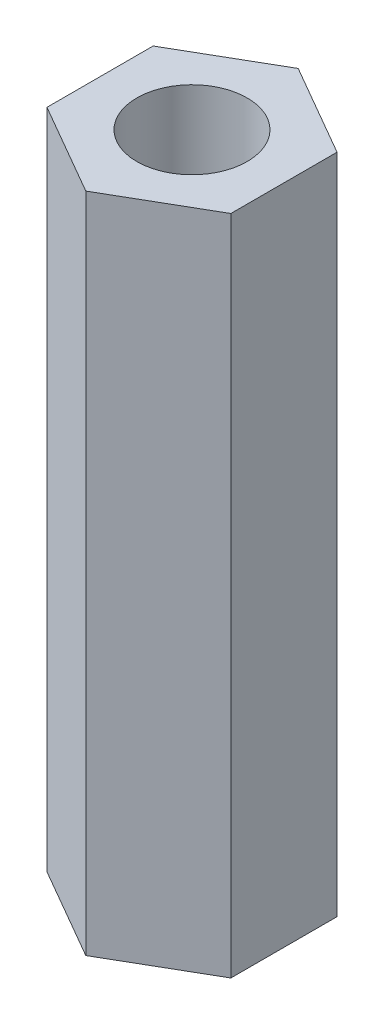
ISO-10303-21;
HEADER;
FILE_DESCRIPTION(('STEP AP214'),'2;1');
FILE_NAME('part.step','',(''),(''),'','','');
FILE_SCHEMA(('AUTOMOTIVE_DESIGN { 1 0 10303 214 1 1 1 1 }'));
ENDSEC;
DATA;
#1=APPLICATION_CONTEXT('core data for automotive mechanical design processes');
#2=APPLICATION_PROTOCOL_DEFINITION('international standard','automotive_design',2000,#1);
#3=PRODUCT_CONTEXT('',#1,'mechanical');
#4=PRODUCT('Part','Part','',(#3));
#5=PRODUCT_RELATED_PRODUCT_CATEGORY('part','',(#4));
#6=PRODUCT_DEFINITION_FORMATION('','',#4);
#7=PRODUCT_DEFINITION_CONTEXT('part definition',#1,'design');
#8=PRODUCT_DEFINITION('design','',#6,#7);
#9=PRODUCT_DEFINITION_SHAPE('','',#8);
#10=(LENGTH_UNIT() NAMED_UNIT(*) SI_UNIT(.MILLI.,.METRE.));
#11=(NAMED_UNIT(*) PLANE_ANGLE_UNIT() SI_UNIT($,.RADIAN.));
#12=(NAMED_UNIT(*) SI_UNIT($,.STERADIAN.) SOLID_ANGLE_UNIT());
#13=UNCERTAINTY_MEASURE_WITH_UNIT(LENGTH_MEASURE(1.E-05),#10,'distance_accuracy_value','');
#14=(GEOMETRIC_REPRESENTATION_CONTEXT(3) GLOBAL_UNCERTAINTY_ASSIGNED_CONTEXT((#13)) GLOBAL_UNIT_ASSIGNED_CONTEXT((#10,
#11,#12)) REPRESENTATION_CONTEXT('',''));
#15=CARTESIAN_POINT('',(0.,0.,0.));
#16=DIRECTION('',(0.,0.,1.));
#17=DIRECTION('',(1.,0.,0.));
#18=AXIS2_PLACEMENT_3D('',#15,#16,#17);
#19=CARTESIAN_POINT('',(0.,18.,0.));
#20=DIRECTION('',(0.,1.,0.));
#21=DIRECTION('',(0.,0.,1.));
#22=AXIS2_PLACEMENT_3D('',#19,#20,#21);
#23=PLANE('',#22);
#24=DIRECTION('',(-0.866025403784439,0.,-0.5));
#25=VECTOR('',#24,1.);
#26=CARTESIAN_POINT('',(2.5,18.,-1.44337567297407));
#27=LINE('',#26,#25);
#28=CARTESIAN_POINT('',(2.5,18.,-1.44337567297407));
#29=VERTEX_POINT('',#28);
#30=CARTESIAN_POINT('',(0.,18.,-2.88675134594813));
#31=VERTEX_POINT('',#30);
#32=EDGE_CURVE('E129',#29,#31,#27,.T.);
#33=ORIENTED_EDGE('',*,*,#32,.T.);
#34=DIRECTION('',(-0.866025403784439,0.,0.5));
#35=VECTOR('',#34,1.);
#36=CARTESIAN_POINT('',(0.,18.,-2.88675134594813));
#37=LINE('',#36,#35);
#38=CARTESIAN_POINT('',(-2.5,18.,-1.44337567297407));
#39=VERTEX_POINT('',#38);
#40=EDGE_CURVE('E87',#31,#39,#37,.T.);
#41=ORIENTED_EDGE('',*,*,#40,.T.);
#42=DIRECTION('',(0.,0.,1.));
#43=VECTOR('',#42,1.);
#44=CARTESIAN_POINT('',(-2.5,18.,-1.44337567297407));
#45=LINE('',#44,#43);
#46=CARTESIAN_POINT('',(-2.5,18.,1.44337567297406));
#47=VERTEX_POINT('',#46);
#48=EDGE_CURVE('E100',#39,#47,#45,.T.);
#49=ORIENTED_EDGE('',*,*,#48,.T.);
#50=DIRECTION('',(0.866025403784439,0.,0.5));
#51=VECTOR('',#50,1.);
#52=CARTESIAN_POINT('',(-2.5,18.,1.44337567297406));
#53=LINE('',#52,#51);
#54=CARTESIAN_POINT('',(0.,18.,2.88675134594813));
#55=VERTEX_POINT('',#54);
#56=EDGE_CURVE('E94',#47,#55,#53,.T.);
#57=ORIENTED_EDGE('',*,*,#56,.T.);
#58=DIRECTION('',(0.866025403784439,0.,-0.5));
#59=VECTOR('',#58,1.);
#60=CARTESIAN_POINT('',(0.,18.,2.88675134594813));
#61=LINE('',#60,#59);
#62=CARTESIAN_POINT('',(2.5,18.,1.44337567297407));
#63=VERTEX_POINT('',#62);
#64=EDGE_CURVE('E98',#55,#63,#61,.T.);
#65=ORIENTED_EDGE('',*,*,#64,.T.);
#66=DIRECTION('',(0.,0.,-1.));
#67=VECTOR('',#66,1.);
#68=CARTESIAN_POINT('',(2.5,18.,1.44337567297407));
#69=LINE('',#68,#67);
#70=EDGE_CURVE('E50',#63,#29,#69,.T.);
#71=ORIENTED_EDGE('',*,*,#70,.T.);
#72=EDGE_LOOP('',(#33,#41,#49,#57,#65,#71));
#73=FACE_BOUND('',#72,.T.);
#74=CARTESIAN_POINT('',(0.,18.,0.));
#75=DIRECTION('',(0.,1.,0.));
#76=DIRECTION('',(0.,0.,1.));
#77=AXIS2_PLACEMENT_3D('',#74,#75,#76);
#78=CIRCLE('',#77,1.5);
#79=CARTESIAN_POINT('',(0.,18.,1.5));
#80=VERTEX_POINT('',#79);
#81=EDGE_CURVE('E122',#80,#80,#78,.T.);
#82=ORIENTED_EDGE('',*,*,#81,.F.);
#83=EDGE_LOOP('',(#82));
#84=FACE_BOUND('',#83,.T.);
#85=ADVANCED_FACE('F33',(#73,#84),#23,.T.);
#86=CARTESIAN_POINT('',(0.,0.,0.));
#87=DIRECTION('',(0.,1.,0.));
#88=DIRECTION('',(0.,0.,1.));
#89=AXIS2_PLACEMENT_3D('',#86,#87,#88);
#90=PLANE('',#89);
#91=DIRECTION('',(-0.866025403784439,0.,-0.5));
#92=VECTOR('',#91,1.);
#93=CARTESIAN_POINT('',(2.5,0.,-1.44337567297407));
#94=LINE('',#93,#92);
#95=CARTESIAN_POINT('',(2.5,0.,-1.44337567297407));
#96=VERTEX_POINT('',#95);
#97=CARTESIAN_POINT('',(0.,0.,-2.88675134594813));
#98=VERTEX_POINT('',#97);
#99=EDGE_CURVE('E118',#96,#98,#94,.T.);
#100=ORIENTED_EDGE('',*,*,#99,.F.);
#101=DIRECTION('',(0.,0.,-1.));
#102=VECTOR('',#101,1.);
#103=CARTESIAN_POINT('',(2.5,0.,1.44337567297407));
#104=LINE('',#103,#102);
#105=CARTESIAN_POINT('',(2.5,0.,1.44337567297407));
#106=VERTEX_POINT('',#105);
#107=EDGE_CURVE('E79',#106,#96,#104,.T.);
#108=ORIENTED_EDGE('',*,*,#107,.F.);
#109=DIRECTION('',(0.866025403784439,0.,-0.5));
#110=VECTOR('',#109,1.);
#111=CARTESIAN_POINT('',(0.,0.,2.88675134594813));
#112=LINE('',#111,#110);
#113=CARTESIAN_POINT('',(0.,0.,2.88675134594813));
#114=VERTEX_POINT('',#113);
#115=EDGE_CURVE('E73',#114,#106,#112,.T.);
#116=ORIENTED_EDGE('',*,*,#115,.F.);
#117=DIRECTION('',(0.866025403784439,0.,0.5));
#118=VECTOR('',#117,1.);
#119=CARTESIAN_POINT('',(-2.5,0.,1.44337567297406));
#120=LINE('',#119,#118);
#121=CARTESIAN_POINT('',(-2.5,0.,1.44337567297406));
#122=VERTEX_POINT('',#121);
#123=EDGE_CURVE('E108',#122,#114,#120,.T.);
#124=ORIENTED_EDGE('',*,*,#123,.F.);
#125=DIRECTION('',(0.,0.,1.));
#126=VECTOR('',#125,1.);
#127=CARTESIAN_POINT('',(-2.5,0.,-1.44337567297407));
#128=LINE('',#127,#126);
#129=CARTESIAN_POINT('',(-2.5,0.,-1.44337567297407));
#130=VERTEX_POINT('',#129);
#131=EDGE_CURVE('E124',#130,#122,#128,.T.);
#132=ORIENTED_EDGE('',*,*,#131,.F.);
#133=DIRECTION('',(-0.866025403784439,0.,0.5));
#134=VECTOR('',#133,1.);
#135=CARTESIAN_POINT('',(0.,0.,-2.88675134594813));
#136=LINE('',#135,#134);
#137=EDGE_CURVE('E121',#98,#130,#136,.T.);
#138=ORIENTED_EDGE('',*,*,#137,.F.);
#139=EDGE_LOOP('',(#100,#108,#116,#124,#132,#138));
#140=FACE_BOUND('',#139,.T.);
#141=CARTESIAN_POINT('',(0.,0.,0.));
#142=DIRECTION('',(0.,1.,0.));
#143=DIRECTION('',(0.,0.,1.));
#144=AXIS2_PLACEMENT_3D('',#141,#142,#143);
#145=CIRCLE('',#144,1.5);
#146=CARTESIAN_POINT('',(0.,0.,1.5));
#147=VERTEX_POINT('',#146);
#148=EDGE_CURVE('E222',#147,#147,#145,.T.);
#149=ORIENTED_EDGE('',*,*,#148,.T.);
#150=EDGE_LOOP('',(#149));
#151=FACE_BOUND('',#150,.T.);
#152=ADVANCED_FACE('F138',(#140,#151),#90,.F.);
#153=CARTESIAN_POINT('',(2.5,18.,-1.44337567297407));
#154=DIRECTION('',(-0.5,0.,0.866025403784439));
#155=DIRECTION('',(0.866025403784439,0.,0.5));
#156=AXIS2_PLACEMENT_3D('',#153,#154,#155);
#157=PLANE('',#156);
#158=ORIENTED_EDGE('',*,*,#99,.T.);
#159=DIRECTION('',(0.,-1.,0.));
#160=VECTOR('',#159,1.);
#161=CARTESIAN_POINT('',(0.,18.,-2.88675134594813));
#162=LINE('',#161,#160);
#163=EDGE_CURVE('E11',#31,#98,#162,.T.);
#164=ORIENTED_EDGE('',*,*,#163,.F.);
#165=ORIENTED_EDGE('',*,*,#32,.F.);
#166=DIRECTION('',(0.,-1.,0.));
#167=VECTOR('',#166,1.);
#168=CARTESIAN_POINT('',(2.5,18.,-1.44337567297407));
#169=LINE('',#168,#167);
#170=EDGE_CURVE('E114',#29,#96,#169,.T.);
#171=ORIENTED_EDGE('',*,*,#170,.T.);
#172=EDGE_LOOP('',(#158,#164,#165,#171));
#173=FACE_BOUND('',#172,.T.);
#174=ADVANCED_FACE('F35',(#173),#157,.F.);
#175=CARTESIAN_POINT('',(0.,18.,-2.88675134594813));
#176=DIRECTION('',(0.5,0.,0.866025403784439));
#177=DIRECTION('',(0.866025403784439,0.,-0.5));
#178=AXIS2_PLACEMENT_3D('',#175,#176,#177);
#179=PLANE('',#178);
#180=ORIENTED_EDGE('',*,*,#137,.T.);
#181=DIRECTION('',(0.,-1.,0.));
#182=VECTOR('',#181,1.);
#183=CARTESIAN_POINT('',(-2.5,18.,-1.44337567297407));
#184=LINE('',#183,#182);
#185=EDGE_CURVE('E42',#39,#130,#184,.T.);
#186=ORIENTED_EDGE('',*,*,#185,.F.);
#187=ORIENTED_EDGE('',*,*,#40,.F.);
#188=ORIENTED_EDGE('',*,*,#163,.T.);
#189=EDGE_LOOP('',(#180,#186,#187,#188));
#190=FACE_BOUND('',#189,.T.);
#191=ADVANCED_FACE('F163',(#190),#179,.F.);
#192=CARTESIAN_POINT('',(-2.5,18.,-1.44337567297407));
#193=DIRECTION('',(1.,0.,0.));
#194=DIRECTION('',(0.,0.,-1.));
#195=AXIS2_PLACEMENT_3D('',#192,#193,#194);
#196=PLANE('',#195);
#197=ORIENTED_EDGE('',*,*,#131,.T.);
#198=DIRECTION('',(0.,-1.,0.));
#199=VECTOR('',#198,1.);
#200=CARTESIAN_POINT('',(-2.5,18.,1.44337567297406));
#201=LINE('',#200,#199);
#202=EDGE_CURVE('E109',#47,#122,#201,.T.);
#203=ORIENTED_EDGE('',*,*,#202,.F.);
#204=ORIENTED_EDGE('',*,*,#48,.F.);
#205=ORIENTED_EDGE('',*,*,#185,.T.);
#206=EDGE_LOOP('',(#197,#203,#204,#205));
#207=FACE_BOUND('',#206,.T.);
#208=ADVANCED_FACE('F135',(#207),#196,.F.);
#209=CARTESIAN_POINT('',(-2.5,18.,1.44337567297406));
#210=DIRECTION('',(0.5,0.,-0.866025403784439));
#211=DIRECTION('',(-0.866025403784439,0.,-0.5));
#212=AXIS2_PLACEMENT_3D('',#209,#210,#211);
#213=PLANE('',#212);
#214=ORIENTED_EDGE('',*,*,#123,.T.);
#215=DIRECTION('',(0.,-1.,0.));
#216=VECTOR('',#215,1.);
#217=CARTESIAN_POINT('',(0.,18.,2.88675134594813));
#218=LINE('',#217,#216);
#219=EDGE_CURVE('E105',#55,#114,#218,.T.);
#220=ORIENTED_EDGE('',*,*,#219,.F.);
#221=ORIENTED_EDGE('',*,*,#56,.F.);
#222=ORIENTED_EDGE('',*,*,#202,.T.);
#223=EDGE_LOOP('',(#214,#220,#221,#222));
#224=FACE_BOUND('',#223,.T.);
#225=ADVANCED_FACE('F106',(#224),#213,.F.);
#226=CARTESIAN_POINT('',(0.,18.,2.88675134594813));
#227=DIRECTION('',(-0.5,0.,-0.866025403784439));
#228=DIRECTION('',(-0.866025403784439,0.,0.5));
#229=AXIS2_PLACEMENT_3D('',#226,#227,#228);
#230=PLANE('',#229);
#231=ORIENTED_EDGE('',*,*,#115,.T.);
#232=DIRECTION('',(0.,-1.,0.));
#233=VECTOR('',#232,1.);
#234=CARTESIAN_POINT('',(2.5,18.,1.44337567297407));
#235=LINE('',#234,#233);
#236=EDGE_CURVE('E110',#63,#106,#235,.T.);
#237=ORIENTED_EDGE('',*,*,#236,.F.);
#238=ORIENTED_EDGE('',*,*,#64,.F.);
#239=ORIENTED_EDGE('',*,*,#219,.T.);
#240=EDGE_LOOP('',(#231,#237,#238,#239));
#241=FACE_BOUND('',#240,.T.);
#242=ADVANCED_FACE('F112',(#241),#230,.F.);
#243=CARTESIAN_POINT('',(2.5,18.,1.44337567297407));
#244=DIRECTION('',(-1.,0.,0.));
#245=DIRECTION('',(0.,0.,1.));
#246=AXIS2_PLACEMENT_3D('',#243,#244,#245);
#247=PLANE('',#246);
#248=ORIENTED_EDGE('',*,*,#107,.T.);
#249=ORIENTED_EDGE('',*,*,#170,.F.);
#250=ORIENTED_EDGE('',*,*,#70,.F.);
#251=ORIENTED_EDGE('',*,*,#236,.T.);
#252=EDGE_LOOP('',(#248,#249,#250,#251));
#253=FACE_BOUND('',#252,.T.);
#254=ADVANCED_FACE('F143',(#253),#247,.F.);
#255=CARTESIAN_POINT('',(0.,18.,0.));
#256=DIRECTION('',(0.,-1.,0.));
#257=DIRECTION('',(0.,0.,-1.));
#258=AXIS2_PLACEMENT_3D('',#255,#256,#257);
#259=CYLINDRICAL_SURFACE('',#258,1.5);
#260=ORIENTED_EDGE('',*,*,#81,.T.);
#261=EDGE_LOOP('',(#260));
#262=FACE_BOUND('',#261,.T.);
#263=ORIENTED_EDGE('',*,*,#148,.F.);
#264=EDGE_LOOP('',(#263));
#265=FACE_BOUND('',#264,.T.);
#266=ADVANCED_FACE('F145',(#262,#265),#259,.F.);
#267=CLOSED_SHELL('',(#85,#152,#174,#191,#208,#225,#242,#254,#266));
#268=MANIFOLD_SOLID_BREP('B2',#267);
#269=ADVANCED_BREP_SHAPE_REPRESENTATION('',(#18,#268),#14);
#270=SHAPE_DEFINITION_REPRESENTATION(#9,#269);
ENDSEC;
END-ISO-10303-21;
